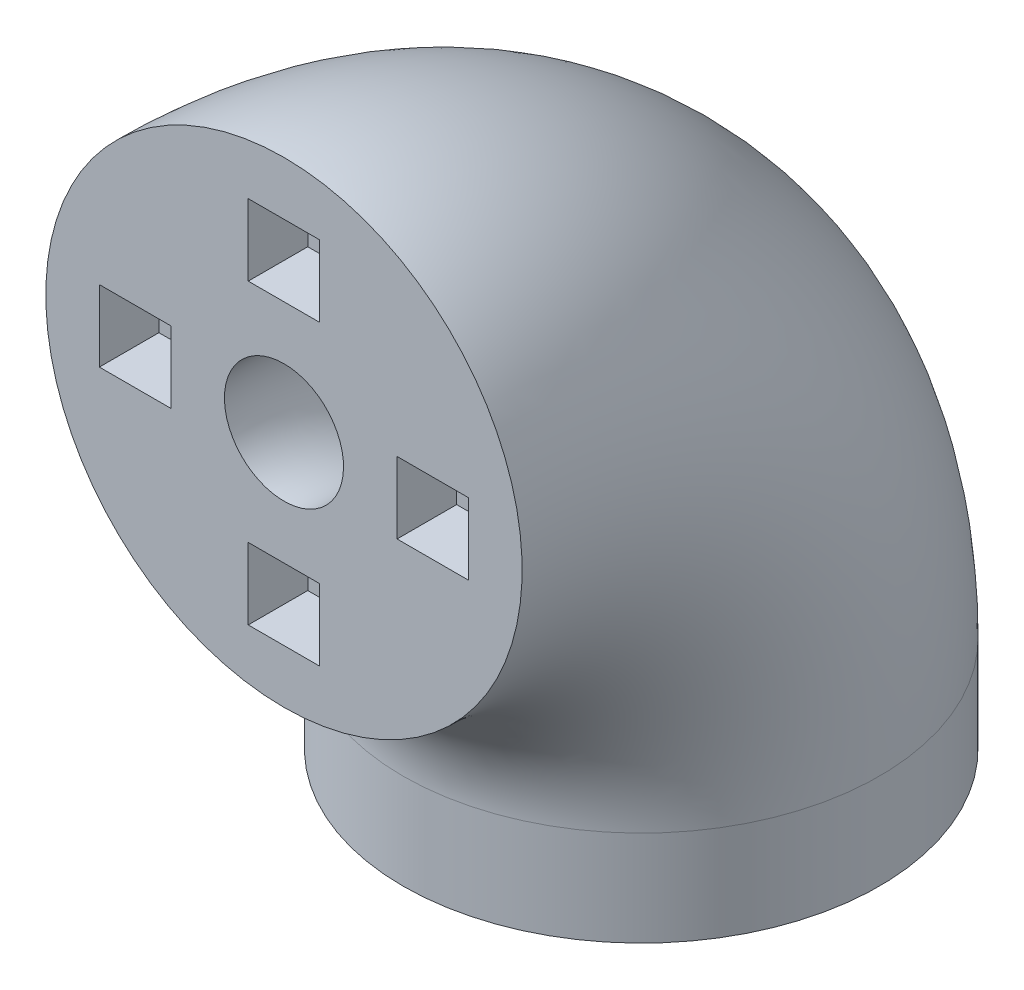
ISO-10303-21;
HEADER;
FILE_DESCRIPTION(('STEP AP214'),'2;1');
FILE_NAME('part.step','',(''),(''),'','','');
FILE_SCHEMA(('AUTOMOTIVE_DESIGN { 1 0 10303 214 1 1 1 1 }'));
ENDSEC;
DATA;
#1=APPLICATION_CONTEXT('core data for automotive mechanical design processes');
#2=APPLICATION_PROTOCOL_DEFINITION('international standard','automotive_design',2000,#1);
#3=PRODUCT_CONTEXT('',#1,'mechanical');
#4=PRODUCT('Part','Part','',(#3));
#5=PRODUCT_RELATED_PRODUCT_CATEGORY('part','',(#4));
#6=PRODUCT_DEFINITION_FORMATION('','',#4);
#7=PRODUCT_DEFINITION_CONTEXT('part definition',#1,'design');
#8=PRODUCT_DEFINITION('design','',#6,#7);
#9=PRODUCT_DEFINITION_SHAPE('','',#8);
#10=(LENGTH_UNIT() NAMED_UNIT(*) SI_UNIT(.MILLI.,.METRE.));
#11=(NAMED_UNIT(*) PLANE_ANGLE_UNIT() SI_UNIT($,.RADIAN.));
#12=(NAMED_UNIT(*) SI_UNIT($,.STERADIAN.) SOLID_ANGLE_UNIT());
#13=UNCERTAINTY_MEASURE_WITH_UNIT(LENGTH_MEASURE(1.E-05),#10,'distance_accuracy_value','');
#14=(GEOMETRIC_REPRESENTATION_CONTEXT(3) GLOBAL_UNCERTAINTY_ASSIGNED_CONTEXT((#13)) GLOBAL_UNIT_ASSIGNED_CONTEXT((#10,
#11,#12)) REPRESENTATION_CONTEXT('',''));
#15=CARTESIAN_POINT('',(0.,0.,0.));
#16=DIRECTION('',(0.,0.,1.));
#17=DIRECTION('',(1.,0.,0.));
#18=AXIS2_PLACEMENT_3D('',#15,#16,#17);
#19=CARTESIAN_POINT('',(0.,0.,0.));
#20=DIRECTION('',(1.,0.,0.));
#21=DIRECTION('',(0.,0.,-1.));
#22=AXIS2_PLACEMENT_3D('',#19,#20,#21);
#23=TOROIDAL_SURFACE('',#22,30.,20.);
#24=CARTESIAN_POINT('',(0.,0.,-30.));
#25=DIRECTION('',(0.,-1.,0.));
#26=DIRECTION('',(0.,0.,-1.));
#27=AXIS2_PLACEMENT_3D('',#24,#25,#26);
#28=CIRCLE('',#27,20.);
#29=CARTESIAN_POINT('',(0.,0.,-50.));
#30=VERTEX_POINT('',#29);
#31=EDGE_CURVE('E337',#30,#30,#28,.T.);
#32=CARTESIAN_POINT('',(0.,30.,0.));
#33=DIRECTION('',(0.,0.,1.));
#34=DIRECTION('',(0.,-1.,0.));
#35=AXIS2_PLACEMENT_3D('',#32,#33,#34);
#36=CIRCLE('',#35,20.);
#37=CARTESIAN_POINT('',(0.,50.,0.));
#38=VERTEX_POINT('',#37);
#39=EDGE_CURVE('E42',#38,#38,#36,.T.);
#40=CARTESIAN_POINT('',(0.,0.,0.));
#41=DIRECTION('',(1.,0.,0.));
#42=DIRECTION('',(0.,0.,-1.));
#43=AXIS2_PLACEMENT_3D('',#40,#41,#42);
#44=CIRCLE('',#43,50.);
#45=EDGE_CURVE('',#30,#38,#44,.T.);
#46=ORIENTED_EDGE('',*,*,#31,.F.);
#47=ORIENTED_EDGE('',*,*,#39,.F.);
#48=ORIENTED_EDGE('',*,*,#45,.T.);
#49=ORIENTED_EDGE('',*,*,#45,.F.);
#50=EDGE_LOOP('',(#46,#48,#47,#49));
#51=FACE_BOUND('',#50,.T.);
#52=ADVANCED_FACE('F39',(#51),#23,.T.);
#53=CARTESIAN_POINT('',(0.,30.,0.));
#54=DIRECTION('',(0.,0.,1.));
#55=DIRECTION('',(0.,-1.,0.));
#56=AXIS2_PLACEMENT_3D('',#53,#54,#55);
#57=PLANE('',#56);
#58=DIRECTION('',(0.,1.,0.));
#59=VECTOR('',#58,1.);
#60=CARTESIAN_POINT('',(-9.50000000000001,33.,0.));
#61=LINE('',#60,#59);
#62=CARTESIAN_POINT('',(-9.50000000000001,27.,0.));
#63=VERTEX_POINT('',#62);
#64=CARTESIAN_POINT('',(-9.50000000000001,33.,0.));
#65=VERTEX_POINT('',#64);
#66=EDGE_CURVE('E54',#63,#65,#61,.T.);
#67=ORIENTED_EDGE('',*,*,#66,.F.);
#68=DIRECTION('',(1.,0.,0.));
#69=VECTOR('',#68,1.);
#70=CARTESIAN_POINT('',(-15.5,27.,0.));
#71=LINE('',#70,#69);
#72=CARTESIAN_POINT('',(-15.5,27.,0.));
#73=VERTEX_POINT('',#72);
#74=EDGE_CURVE('E175',#73,#63,#71,.T.);
#75=ORIENTED_EDGE('',*,*,#74,.F.);
#76=DIRECTION('',(0.,-1.,0.));
#77=VECTOR('',#76,1.);
#78=CARTESIAN_POINT('',(-15.5,33.,0.));
#79=LINE('',#78,#77);
#80=CARTESIAN_POINT('',(-15.5,33.,0.));
#81=VERTEX_POINT('',#80);
#82=EDGE_CURVE('E179',#81,#73,#79,.T.);
#83=ORIENTED_EDGE('',*,*,#82,.F.);
#84=DIRECTION('',(-1.,0.,0.));
#85=VECTOR('',#84,1.);
#86=CARTESIAN_POINT('',(-15.5,33.,0.));
#87=LINE('',#86,#85);
#88=EDGE_CURVE('E188',#65,#81,#87,.T.);
#89=ORIENTED_EDGE('',*,*,#88,.F.);
#90=EDGE_LOOP('',(#67,#75,#83,#89));
#91=FACE_BOUND('',#90,.T.);
#92=DIRECTION('',(0.,-1.,0.));
#93=VECTOR('',#92,1.);
#94=CARTESIAN_POINT('',(-3.00000000000082,45.5000000000016,0.));
#95=LINE('',#94,#93);
#96=CARTESIAN_POINT('',(-3.00000000000082,45.5000000000016,0.));
#97=VERTEX_POINT('',#96);
#98=CARTESIAN_POINT('',(-3.00000000000084,39.5000000000016,0.));
#99=VERTEX_POINT('',#98);
#100=EDGE_CURVE('E62',#97,#99,#95,.T.);
#101=ORIENTED_EDGE('',*,*,#100,.F.);
#102=DIRECTION('',(-1.,0.,0.));
#103=VECTOR('',#102,1.);
#104=CARTESIAN_POINT('',(2.99999999999918,45.5000000000016,0.));
#105=LINE('',#104,#103);
#106=CARTESIAN_POINT('',(2.99999999999918,45.5000000000016,0.));
#107=VERTEX_POINT('',#106);
#108=EDGE_CURVE('E209',#107,#97,#105,.T.);
#109=ORIENTED_EDGE('',*,*,#108,.F.);
#110=DIRECTION('',(0.,1.,0.));
#111=VECTOR('',#110,1.);
#112=CARTESIAN_POINT('',(2.99999999999918,45.5000000000016,0.));
#113=LINE('',#112,#111);
#114=CARTESIAN_POINT('',(2.99999999999916,39.5000000000016,0.));
#115=VERTEX_POINT('',#114);
#116=EDGE_CURVE('E229',#115,#107,#113,.T.);
#117=ORIENTED_EDGE('',*,*,#116,.F.);
#118=DIRECTION('',(1.,0.,0.));
#119=VECTOR('',#118,1.);
#120=CARTESIAN_POINT('',(2.99999999999916,39.5000000000016,0.));
#121=LINE('',#120,#119);
#122=EDGE_CURVE('E224',#99,#115,#121,.T.);
#123=ORIENTED_EDGE('',*,*,#122,.F.);
#124=EDGE_LOOP('',(#101,#109,#117,#123));
#125=FACE_BOUND('',#124,.T.);
#126=DIRECTION('',(-1.,0.,0.));
#127=VECTOR('',#126,1.);
#128=CARTESIAN_POINT('',(15.5000000000007,33.0000000000024,0.));
#129=LINE('',#128,#127);
#130=CARTESIAN_POINT('',(15.5000000000007,33.0000000000024,0.));
#131=VERTEX_POINT('',#130);
#132=CARTESIAN_POINT('',(9.50000000000073,33.0000000000024,0.));
#133=VERTEX_POINT('',#132);
#134=EDGE_CURVE('E264',#131,#133,#129,.T.);
#135=ORIENTED_EDGE('',*,*,#134,.F.);
#136=DIRECTION('',(0.,1.,0.));
#137=VECTOR('',#136,1.);
#138=CARTESIAN_POINT('',(15.5000000000007,27.0000000000024,0.));
#139=LINE('',#138,#137);
#140=CARTESIAN_POINT('',(15.5000000000007,27.0000000000024,0.));
#141=VERTEX_POINT('',#140);
#142=EDGE_CURVE('E251',#141,#131,#139,.T.);
#143=ORIENTED_EDGE('',*,*,#142,.F.);
#144=DIRECTION('',(1.,0.,0.));
#145=VECTOR('',#144,1.);
#146=CARTESIAN_POINT('',(15.5000000000007,27.0000000000024,0.));
#147=LINE('',#146,#145);
#148=CARTESIAN_POINT('',(9.50000000000069,27.0000000000024,0.));
#149=VERTEX_POINT('',#148);
#150=EDGE_CURVE('E272',#149,#141,#147,.T.);
#151=ORIENTED_EDGE('',*,*,#150,.F.);
#152=DIRECTION('',(0.,-1.,0.));
#153=VECTOR('',#152,1.);
#154=CARTESIAN_POINT('',(9.50000000000069,27.0000000000024,0.));
#155=LINE('',#154,#153);
#156=EDGE_CURVE('E267',#133,#149,#155,.T.);
#157=ORIENTED_EDGE('',*,*,#156,.F.);
#158=EDGE_LOOP('',(#135,#143,#151,#157));
#159=FACE_BOUND('',#158,.T.);
#160=DIRECTION('',(0.,1.,0.));
#161=VECTOR('',#160,1.);
#162=CARTESIAN_POINT('',(3.00000000000143,14.5000000000008,0.));
#163=LINE('',#162,#161);
#164=CARTESIAN_POINT('',(3.00000000000143,14.5000000000008,0.));
#165=VERTEX_POINT('',#164);
#166=CARTESIAN_POINT('',(3.00000000000149,20.5000000000008,0.));
#167=VERTEX_POINT('',#166);
#168=EDGE_CURVE('E308',#165,#167,#163,.T.);
#169=ORIENTED_EDGE('',*,*,#168,.F.);
#170=DIRECTION('',(1.,0.,0.));
#171=VECTOR('',#170,1.);
#172=CARTESIAN_POINT('',(-2.99999999999857,14.5000000000009,0.));
#173=LINE('',#172,#171);
#174=CARTESIAN_POINT('',(-2.99999999999857,14.5000000000009,0.));
#175=VERTEX_POINT('',#174);
#176=EDGE_CURVE('E295',#175,#165,#173,.T.);
#177=ORIENTED_EDGE('',*,*,#176,.F.);
#178=DIRECTION('',(0.,-1.,0.));
#179=VECTOR('',#178,1.);
#180=CARTESIAN_POINT('',(-2.99999999999857,14.5000000000009,0.));
#181=LINE('',#180,#179);
#182=CARTESIAN_POINT('',(-2.9999999999985,20.5000000000009,0.));
#183=VERTEX_POINT('',#182);
#184=EDGE_CURVE('E315',#183,#175,#181,.T.);
#185=ORIENTED_EDGE('',*,*,#184,.F.);
#186=DIRECTION('',(-1.,0.,0.));
#187=VECTOR('',#186,1.);
#188=CARTESIAN_POINT('',(-2.9999999999985,20.5000000000009,0.));
#189=LINE('',#188,#187);
#190=EDGE_CURVE('E311',#167,#183,#189,.T.);
#191=ORIENTED_EDGE('',*,*,#190,.F.);
#192=EDGE_LOOP('',(#169,#177,#185,#191));
#193=FACE_BOUND('',#192,.T.);
#194=CARTESIAN_POINT('',(0.,30.,0.));
#195=DIRECTION('',(0.,0.,1.));
#196=DIRECTION('',(0.,-1.,0.));
#197=AXIS2_PLACEMENT_3D('',#194,#195,#196);
#198=CIRCLE('',#197,5.);
#199=CARTESIAN_POINT('',(0.,35.,0.));
#200=VERTEX_POINT('',#199);
#201=EDGE_CURVE('E11',#200,#200,#198,.F.);
#202=ORIENTED_EDGE('',*,*,#201,.T.);
#203=EDGE_LOOP('',(#202));
#204=FACE_BOUND('',#203,.T.);
#205=ORIENTED_EDGE('',*,*,#39,.T.);
#206=EDGE_LOOP('',(#205));
#207=FACE_BOUND('',#206,.T.);
#208=ADVANCED_FACE('F352',(#91,#125,#159,#193,#204,#207),#57,.T.);
#209=CARTESIAN_POINT('',(0.,0.,0.));
#210=DIRECTION('',(1.,0.,0.));
#211=DIRECTION('',(0.,0.,-1.));
#212=AXIS2_PLACEMENT_3D('',#209,#210,#211);
#213=TOROIDAL_SURFACE('',#212,30.,5.);
#214=CARTESIAN_POINT('',(0.,0.,-30.));
#215=DIRECTION('',(0.,-1.,0.));
#216=DIRECTION('',(0.,0.,-1.));
#217=AXIS2_PLACEMENT_3D('',#214,#215,#216);
#218=CIRCLE('',#217,5.);
#219=CARTESIAN_POINT('',(0.,0.,-35.));
#220=VERTEX_POINT('',#219);
#221=EDGE_CURVE('E198',#220,#220,#218,.T.);
#222=CARTESIAN_POINT('',(0.,0.,0.));
#223=DIRECTION('',(1.,0.,0.));
#224=DIRECTION('',(0.,0.,-1.));
#225=AXIS2_PLACEMENT_3D('',#222,#223,#224);
#226=CIRCLE('',#225,35.);
#227=EDGE_CURVE('',#220,#200,#226,.T.);
#228=ORIENTED_EDGE('',*,*,#221,.T.);
#229=ORIENTED_EDGE('',*,*,#201,.F.);
#230=ORIENTED_EDGE('',*,*,#227,.T.);
#231=ORIENTED_EDGE('',*,*,#227,.F.);
#232=EDGE_LOOP('',(#228,#230,#229,#231));
#233=FACE_BOUND('',#232,.T.);
#234=ADVANCED_FACE('F358',(#233),#213,.F.);
#235=CARTESIAN_POINT('',(0.,-8.,-30.));
#236=DIRECTION('',(0.,-1.,0.));
#237=DIRECTION('',(0.,0.,-1.));
#238=AXIS2_PLACEMENT_3D('',#235,#236,#237);
#239=PLANE('',#238);
#240=CARTESIAN_POINT('',(0.,-8.,-30.));
#241=DIRECTION('',(0.,-1.,0.));
#242=DIRECTION('',(0.,0.,-1.));
#243=AXIS2_PLACEMENT_3D('',#240,#241,#242);
#244=CIRCLE('',#243,20.);
#245=CARTESIAN_POINT('',(0.,-8.,-50.));
#246=VERTEX_POINT('',#245);
#247=EDGE_CURVE('E341',#246,#246,#244,.T.);
#248=ORIENTED_EDGE('',*,*,#247,.T.);
#249=EDGE_LOOP('',(#248));
#250=FACE_BOUND('',#249,.T.);
#251=CARTESIAN_POINT('',(0.,-8.,-30.));
#252=DIRECTION('',(0.,-1.,0.));
#253=DIRECTION('',(0.,0.,-1.));
#254=AXIS2_PLACEMENT_3D('',#251,#252,#253);
#255=CIRCLE('',#254,5.);
#256=CARTESIAN_POINT('',(0.,-8.,-35.));
#257=VERTEX_POINT('',#256);
#258=EDGE_CURVE('E333',#257,#257,#255,.T.);
#259=ORIENTED_EDGE('',*,*,#258,.F.);
#260=EDGE_LOOP('',(#259));
#261=FACE_BOUND('',#260,.T.);
#262=ADVANCED_FACE('F354',(#250,#261),#239,.T.);
#263=CARTESIAN_POINT('',(0.,-8.,-30.));
#264=DIRECTION('',(0.,1.,0.));
#265=DIRECTION('',(0.,0.,1.));
#266=AXIS2_PLACEMENT_3D('',#263,#264,#265);
#267=CYLINDRICAL_SURFACE('',#266,20.);
#268=ORIENTED_EDGE('',*,*,#247,.F.);
#269=EDGE_LOOP('',(#268));
#270=FACE_BOUND('',#269,.T.);
#271=ORIENTED_EDGE('',*,*,#31,.T.);
#272=EDGE_LOOP('',(#271));
#273=FACE_BOUND('',#272,.T.);
#274=ADVANCED_FACE('F349',(#270,#273),#267,.T.);
#275=CARTESIAN_POINT('',(0.,-8.,-30.));
#276=DIRECTION('',(0.,1.,0.));
#277=DIRECTION('',(0.,0.,1.));
#278=AXIS2_PLACEMENT_3D('',#275,#276,#277);
#279=CYLINDRICAL_SURFACE('',#278,5.);
#280=ORIENTED_EDGE('',*,*,#258,.T.);
#281=EDGE_LOOP('',(#280));
#282=FACE_BOUND('',#281,.T.);
#283=ORIENTED_EDGE('',*,*,#221,.F.);
#284=EDGE_LOOP('',(#283));
#285=FACE_BOUND('',#284,.T.);
#286=ADVANCED_FACE('F373',(#282,#285),#279,.F.);
#287=CARTESIAN_POINT('',(3.00000000000143,14.5000000000008,-5.));
#288=DIRECTION('',(1.,0.,0.));
#289=DIRECTION('',(0.,1.,0.));
#290=AXIS2_PLACEMENT_3D('',#287,#288,#289);
#291=PLANE('',#290);
#292=ORIENTED_EDGE('',*,*,#168,.T.);
#293=DIRECTION('',(0.,0.,1.));
#294=VECTOR('',#293,1.);
#295=CARTESIAN_POINT('',(3.00000000000149,20.5000000000008,-5.));
#296=LINE('',#295,#294);
#297=CARTESIAN_POINT('',(3.00000000000149,20.5000000000008,-5.));
#298=VERTEX_POINT('',#297);
#299=EDGE_CURVE('E307',#298,#167,#296,.T.);
#300=ORIENTED_EDGE('',*,*,#299,.F.);
#301=DIRECTION('',(0.,1.,0.));
#302=VECTOR('',#301,1.);
#303=CARTESIAN_POINT('',(3.00000000000143,14.5000000000008,-5.));
#304=LINE('',#303,#302);
#305=CARTESIAN_POINT('',(3.00000000000143,14.5000000000008,-5.));
#306=VERTEX_POINT('',#305);
#307=EDGE_CURVE('E290',#306,#298,#304,.T.);
#308=ORIENTED_EDGE('',*,*,#307,.F.);
#309=DIRECTION('',(0.,0.,1.));
#310=VECTOR('',#309,1.);
#311=CARTESIAN_POINT('',(3.00000000000143,14.5000000000008,-5.));
#312=LINE('',#311,#310);
#313=EDGE_CURVE('E268',#306,#165,#312,.T.);
#314=ORIENTED_EDGE('',*,*,#313,.T.);
#315=EDGE_LOOP('',(#292,#300,#308,#314));
#316=FACE_BOUND('',#315,.T.);
#317=ADVANCED_FACE('F378',(#316),#291,.F.);
#318=CARTESIAN_POINT('',(-2.99999999999857,14.5000000000009,-5.));
#319=DIRECTION('',(0.,-1.,0.));
#320=DIRECTION('',(1.,0.,0.));
#321=AXIS2_PLACEMENT_3D('',#318,#319,#320);
#322=PLANE('',#321);
#323=ORIENTED_EDGE('',*,*,#176,.T.);
#324=ORIENTED_EDGE('',*,*,#313,.F.);
#325=DIRECTION('',(1.,0.,0.));
#326=VECTOR('',#325,1.);
#327=CARTESIAN_POINT('',(-2.99999999999857,14.5000000000009,-5.));
#328=LINE('',#327,#326);
#329=CARTESIAN_POINT('',(-2.99999999999857,14.5000000000009,-5.));
#330=VERTEX_POINT('',#329);
#331=EDGE_CURVE('E303',#330,#306,#328,.T.);
#332=ORIENTED_EDGE('',*,*,#331,.F.);
#333=DIRECTION('',(0.,0.,1.));
#334=VECTOR('',#333,1.);
#335=CARTESIAN_POINT('',(-2.99999999999857,14.5000000000009,-5.));
#336=LINE('',#335,#334);
#337=EDGE_CURVE('E324',#330,#175,#336,.T.);
#338=ORIENTED_EDGE('',*,*,#337,.T.);
#339=EDGE_LOOP('',(#323,#324,#332,#338));
#340=FACE_BOUND('',#339,.T.);
#341=ADVANCED_FACE('F382',(#340),#322,.F.);
#342=CARTESIAN_POINT('',(-2.99999999999857,14.5000000000009,-5.));
#343=DIRECTION('',(-1.,0.,0.));
#344=DIRECTION('',(0.,-1.,0.));
#345=AXIS2_PLACEMENT_3D('',#342,#343,#344);
#346=PLANE('',#345);
#347=ORIENTED_EDGE('',*,*,#184,.T.);
#348=ORIENTED_EDGE('',*,*,#337,.F.);
#349=DIRECTION('',(0.,-1.,0.));
#350=VECTOR('',#349,1.);
#351=CARTESIAN_POINT('',(-2.99999999999857,14.5000000000009,-5.));
#352=LINE('',#351,#350);
#353=CARTESIAN_POINT('',(-2.9999999999985,20.5000000000009,-5.));
#354=VERTEX_POINT('',#353);
#355=EDGE_CURVE('E299',#354,#330,#352,.T.);
#356=ORIENTED_EDGE('',*,*,#355,.F.);
#357=DIRECTION('',(0.,0.,1.));
#358=VECTOR('',#357,1.);
#359=CARTESIAN_POINT('',(-2.9999999999985,20.5000000000009,-5.));
#360=LINE('',#359,#358);
#361=EDGE_CURVE('E327',#354,#183,#360,.T.);
#362=ORIENTED_EDGE('',*,*,#361,.T.);
#363=EDGE_LOOP('',(#347,#348,#356,#362));
#364=FACE_BOUND('',#363,.T.);
#365=ADVANCED_FACE('F388',(#364),#346,.F.);
#366=CARTESIAN_POINT('',(-2.9999999999985,20.5000000000009,-5.));
#367=DIRECTION('',(0.,1.,0.));
#368=DIRECTION('',(-1.,0.,0.));
#369=AXIS2_PLACEMENT_3D('',#366,#367,#368);
#370=PLANE('',#369);
#371=ORIENTED_EDGE('',*,*,#190,.T.);
#372=ORIENTED_EDGE('',*,*,#361,.F.);
#373=DIRECTION('',(-1.,0.,0.));
#374=VECTOR('',#373,1.);
#375=CARTESIAN_POINT('',(-2.9999999999985,20.5000000000009,-5.));
#376=LINE('',#375,#374);
#377=EDGE_CURVE('E294',#298,#354,#376,.T.);
#378=ORIENTED_EDGE('',*,*,#377,.F.);
#379=ORIENTED_EDGE('',*,*,#299,.T.);
#380=EDGE_LOOP('',(#371,#372,#378,#379));
#381=FACE_BOUND('',#380,.T.);
#382=ADVANCED_FACE('F384',(#381),#370,.F.);
#383=CARTESIAN_POINT('',(0.,0.,-5.));
#384=DIRECTION('',(0.,0.,-1.));
#385=DIRECTION('',(-1.,0.,0.));
#386=AXIS2_PLACEMENT_3D('',#383,#384,#385);
#387=PLANE('',#386);
#388=ORIENTED_EDGE('',*,*,#307,.T.);
#389=ORIENTED_EDGE('',*,*,#377,.T.);
#390=ORIENTED_EDGE('',*,*,#355,.T.);
#391=ORIENTED_EDGE('',*,*,#331,.T.);
#392=EDGE_LOOP('',(#388,#389,#390,#391));
#393=FACE_BOUND('',#392,.T.);
#394=ADVANCED_FACE('F387',(#393),#387,.F.);
#395=CARTESIAN_POINT('',(15.5000000000007,33.0000000000024,-5.));
#396=DIRECTION('',(0.,1.,0.));
#397=DIRECTION('',(-1.,0.,0.));
#398=AXIS2_PLACEMENT_3D('',#395,#396,#397);
#399=PLANE('',#398);
#400=ORIENTED_EDGE('',*,*,#134,.T.);
#401=DIRECTION('',(0.,0.,1.));
#402=VECTOR('',#401,1.);
#403=CARTESIAN_POINT('',(9.50000000000073,33.0000000000024,-5.));
#404=LINE('',#403,#402);
#405=CARTESIAN_POINT('',(9.50000000000073,33.0000000000024,-5.));
#406=VERTEX_POINT('',#405);
#407=EDGE_CURVE('E263',#406,#133,#404,.T.);
#408=ORIENTED_EDGE('',*,*,#407,.F.);
#409=DIRECTION('',(-1.,0.,0.));
#410=VECTOR('',#409,1.);
#411=CARTESIAN_POINT('',(15.5000000000007,33.0000000000024,-5.));
#412=LINE('',#411,#410);
#413=CARTESIAN_POINT('',(15.5000000000007,33.0000000000024,-5.));
#414=VERTEX_POINT('',#413);
#415=EDGE_CURVE('E246',#414,#406,#412,.T.);
#416=ORIENTED_EDGE('',*,*,#415,.F.);
#417=DIRECTION('',(0.,0.,1.));
#418=VECTOR('',#417,1.);
#419=CARTESIAN_POINT('',(15.5000000000007,33.0000000000024,-5.));
#420=LINE('',#419,#418);
#421=EDGE_CURVE('E225',#414,#131,#420,.T.);
#422=ORIENTED_EDGE('',*,*,#421,.T.);
#423=EDGE_LOOP('',(#400,#408,#416,#422));
#424=FACE_BOUND('',#423,.T.);
#425=ADVANCED_FACE('F398',(#424),#399,.F.);
#426=CARTESIAN_POINT('',(15.5000000000007,27.0000000000024,-5.));
#427=DIRECTION('',(1.,0.,0.));
#428=DIRECTION('',(0.,1.,0.));
#429=AXIS2_PLACEMENT_3D('',#426,#427,#428);
#430=PLANE('',#429);
#431=ORIENTED_EDGE('',*,*,#142,.T.);
#432=ORIENTED_EDGE('',*,*,#421,.F.);
#433=DIRECTION('',(0.,1.,0.));
#434=VECTOR('',#433,1.);
#435=CARTESIAN_POINT('',(15.5000000000007,27.0000000000024,-5.));
#436=LINE('',#435,#434);
#437=CARTESIAN_POINT('',(15.5000000000007,27.0000000000024,-5.));
#438=VERTEX_POINT('',#437);
#439=EDGE_CURVE('E259',#438,#414,#436,.T.);
#440=ORIENTED_EDGE('',*,*,#439,.F.);
#441=DIRECTION('',(0.,0.,1.));
#442=VECTOR('',#441,1.);
#443=CARTESIAN_POINT('',(15.5000000000007,27.0000000000024,-5.));
#444=LINE('',#443,#442);
#445=EDGE_CURVE('E281',#438,#141,#444,.T.);
#446=ORIENTED_EDGE('',*,*,#445,.T.);
#447=EDGE_LOOP('',(#431,#432,#440,#446));
#448=FACE_BOUND('',#447,.T.);
#449=ADVANCED_FACE('F402',(#448),#430,.F.);
#450=CARTESIAN_POINT('',(15.5000000000007,27.0000000000024,-5.));
#451=DIRECTION('',(0.,-1.,0.));
#452=DIRECTION('',(1.,0.,0.));
#453=AXIS2_PLACEMENT_3D('',#450,#451,#452);
#454=PLANE('',#453);
#455=ORIENTED_EDGE('',*,*,#150,.T.);
#456=ORIENTED_EDGE('',*,*,#445,.F.);
#457=DIRECTION('',(1.,0.,0.));
#458=VECTOR('',#457,1.);
#459=CARTESIAN_POINT('',(15.5000000000007,27.0000000000024,-5.));
#460=LINE('',#459,#458);
#461=CARTESIAN_POINT('',(9.50000000000069,27.0000000000024,-5.));
#462=VERTEX_POINT('',#461);
#463=EDGE_CURVE('E255',#462,#438,#460,.T.);
#464=ORIENTED_EDGE('',*,*,#463,.F.);
#465=DIRECTION('',(0.,0.,1.));
#466=VECTOR('',#465,1.);
#467=CARTESIAN_POINT('',(9.50000000000069,27.0000000000024,-5.));
#468=LINE('',#467,#466);
#469=EDGE_CURVE('E284',#462,#149,#468,.T.);
#470=ORIENTED_EDGE('',*,*,#469,.T.);
#471=EDGE_LOOP('',(#455,#456,#464,#470));
#472=FACE_BOUND('',#471,.T.);
#473=ADVANCED_FACE('F408',(#472),#454,.F.);
#474=CARTESIAN_POINT('',(9.50000000000069,27.0000000000024,-5.));
#475=DIRECTION('',(-1.,0.,0.));
#476=DIRECTION('',(0.,-1.,0.));
#477=AXIS2_PLACEMENT_3D('',#474,#475,#476);
#478=PLANE('',#477);
#479=ORIENTED_EDGE('',*,*,#156,.T.);
#480=ORIENTED_EDGE('',*,*,#469,.F.);
#481=DIRECTION('',(0.,-1.,0.));
#482=VECTOR('',#481,1.);
#483=CARTESIAN_POINT('',(9.50000000000069,27.0000000000024,-5.));
#484=LINE('',#483,#482);
#485=EDGE_CURVE('E250',#406,#462,#484,.T.);
#486=ORIENTED_EDGE('',*,*,#485,.F.);
#487=ORIENTED_EDGE('',*,*,#407,.T.);
#488=EDGE_LOOP('',(#479,#480,#486,#487));
#489=FACE_BOUND('',#488,.T.);
#490=ADVANCED_FACE('F404',(#489),#478,.F.);
#491=CARTESIAN_POINT('',(0.,0.,-5.));
#492=DIRECTION('',(0.,0.,-1.));
#493=DIRECTION('',(-1.,0.,0.));
#494=AXIS2_PLACEMENT_3D('',#491,#492,#493);
#495=PLANE('',#494);
#496=ORIENTED_EDGE('',*,*,#415,.T.);
#497=ORIENTED_EDGE('',*,*,#485,.T.);
#498=ORIENTED_EDGE('',*,*,#463,.T.);
#499=ORIENTED_EDGE('',*,*,#439,.T.);
#500=EDGE_LOOP('',(#496,#497,#498,#499));
#501=FACE_BOUND('',#500,.T.);
#502=ADVANCED_FACE('F407',(#501),#495,.F.);
#503=CARTESIAN_POINT('',(-3.00000000000082,45.5000000000016,-5.));
#504=DIRECTION('',(-1.,0.,0.));
#505=DIRECTION('',(0.,-1.,0.));
#506=AXIS2_PLACEMENT_3D('',#503,#504,#505);
#507=PLANE('',#506);
#508=ORIENTED_EDGE('',*,*,#100,.T.);
#509=DIRECTION('',(0.,0.,1.));
#510=VECTOR('',#509,1.);
#511=CARTESIAN_POINT('',(-3.00000000000084,39.5000000000016,-5.));
#512=LINE('',#511,#510);
#513=CARTESIAN_POINT('',(-3.00000000000084,39.5000000000016,-5.));
#514=VERTEX_POINT('',#513);
#515=EDGE_CURVE('E221',#514,#99,#512,.T.);
#516=ORIENTED_EDGE('',*,*,#515,.F.);
#517=DIRECTION('',(0.,-1.,0.));
#518=VECTOR('',#517,1.);
#519=CARTESIAN_POINT('',(-3.00000000000082,45.5000000000016,-5.));
#520=LINE('',#519,#518);
#521=CARTESIAN_POINT('',(-3.00000000000082,45.5000000000016,-5.));
#522=VERTEX_POINT('',#521);
#523=EDGE_CURVE('E204',#522,#514,#520,.T.);
#524=ORIENTED_EDGE('',*,*,#523,.F.);
#525=DIRECTION('',(0.,0.,1.));
#526=VECTOR('',#525,1.);
#527=CARTESIAN_POINT('',(-3.00000000000082,45.5000000000016,-5.));
#528=LINE('',#527,#526);
#529=EDGE_CURVE('E189',#522,#97,#528,.T.);
#530=ORIENTED_EDGE('',*,*,#529,.T.);
#531=EDGE_LOOP('',(#508,#516,#524,#530));
#532=FACE_BOUND('',#531,.T.);
#533=ADVANCED_FACE('F418',(#532),#507,.F.);
#534=CARTESIAN_POINT('',(2.99999999999918,45.5000000000016,-5.));
#535=DIRECTION('',(0.,1.,0.));
#536=DIRECTION('',(-1.,0.,0.));
#537=AXIS2_PLACEMENT_3D('',#534,#535,#536);
#538=PLANE('',#537);
#539=ORIENTED_EDGE('',*,*,#108,.T.);
#540=ORIENTED_EDGE('',*,*,#529,.F.);
#541=DIRECTION('',(-1.,0.,0.));
#542=VECTOR('',#541,1.);
#543=CARTESIAN_POINT('',(2.99999999999918,45.5000000000016,-5.));
#544=LINE('',#543,#542);
#545=CARTESIAN_POINT('',(2.99999999999918,45.5000000000016,-5.));
#546=VERTEX_POINT('',#545);
#547=EDGE_CURVE('E217',#546,#522,#544,.T.);
#548=ORIENTED_EDGE('',*,*,#547,.F.);
#549=DIRECTION('',(0.,0.,1.));
#550=VECTOR('',#549,1.);
#551=CARTESIAN_POINT('',(2.99999999999918,45.5000000000016,-5.));
#552=LINE('',#551,#550);
#553=EDGE_CURVE('E238',#546,#107,#552,.T.);
#554=ORIENTED_EDGE('',*,*,#553,.T.);
#555=EDGE_LOOP('',(#539,#540,#548,#554));
#556=FACE_BOUND('',#555,.T.);
#557=ADVANCED_FACE('F422',(#556),#538,.F.);
#558=CARTESIAN_POINT('',(2.99999999999918,45.5000000000016,-5.));
#559=DIRECTION('',(1.,0.,0.));
#560=DIRECTION('',(0.,1.,0.));
#561=AXIS2_PLACEMENT_3D('',#558,#559,#560);
#562=PLANE('',#561);
#563=ORIENTED_EDGE('',*,*,#116,.T.);
#564=ORIENTED_EDGE('',*,*,#553,.F.);
#565=DIRECTION('',(0.,1.,0.));
#566=VECTOR('',#565,1.);
#567=CARTESIAN_POINT('',(2.99999999999918,45.5000000000016,-5.));
#568=LINE('',#567,#566);
#569=CARTESIAN_POINT('',(2.99999999999916,39.5000000000016,-5.));
#570=VERTEX_POINT('',#569);
#571=EDGE_CURVE('E213',#570,#546,#568,.T.);
#572=ORIENTED_EDGE('',*,*,#571,.F.);
#573=DIRECTION('',(0.,0.,1.));
#574=VECTOR('',#573,1.);
#575=CARTESIAN_POINT('',(2.99999999999916,39.5000000000016,-5.));
#576=LINE('',#575,#574);
#577=EDGE_CURVE('E241',#570,#115,#576,.T.);
#578=ORIENTED_EDGE('',*,*,#577,.T.);
#579=EDGE_LOOP('',(#563,#564,#572,#578));
#580=FACE_BOUND('',#579,.T.);
#581=ADVANCED_FACE('F427',(#580),#562,.F.);
#582=CARTESIAN_POINT('',(2.99999999999916,39.5000000000016,-5.));
#583=DIRECTION('',(0.,-1.,0.));
#584=DIRECTION('',(1.,0.,0.));
#585=AXIS2_PLACEMENT_3D('',#582,#583,#584);
#586=PLANE('',#585);
#587=ORIENTED_EDGE('',*,*,#122,.T.);
#588=ORIENTED_EDGE('',*,*,#577,.F.);
#589=DIRECTION('',(1.,0.,0.));
#590=VECTOR('',#589,1.);
#591=CARTESIAN_POINT('',(2.99999999999916,39.5000000000016,-5.));
#592=LINE('',#591,#590);
#593=EDGE_CURVE('E208',#514,#570,#592,.T.);
#594=ORIENTED_EDGE('',*,*,#593,.F.);
#595=ORIENTED_EDGE('',*,*,#515,.T.);
#596=EDGE_LOOP('',(#587,#588,#594,#595));
#597=FACE_BOUND('',#596,.T.);
#598=ADVANCED_FACE('F423',(#597),#586,.F.);
#599=CARTESIAN_POINT('',(0.,0.,-5.));
#600=DIRECTION('',(0.,0.,-1.));
#601=DIRECTION('',(-1.,0.,0.));
#602=AXIS2_PLACEMENT_3D('',#599,#600,#601);
#603=PLANE('',#602);
#604=ORIENTED_EDGE('',*,*,#523,.T.);
#605=ORIENTED_EDGE('',*,*,#593,.T.);
#606=ORIENTED_EDGE('',*,*,#571,.T.);
#607=ORIENTED_EDGE('',*,*,#547,.T.);
#608=EDGE_LOOP('',(#604,#605,#606,#607));
#609=FACE_BOUND('',#608,.T.);
#610=ADVANCED_FACE('F426',(#609),#603,.F.);
#611=CARTESIAN_POINT('',(-9.50000000000001,33.,-5.));
#612=DIRECTION('',(1.,0.,0.));
#613=DIRECTION('',(0.,0.,-1.));
#614=AXIS2_PLACEMENT_3D('',#611,#612,#613);
#615=PLANE('',#614);
#616=ORIENTED_EDGE('',*,*,#66,.T.);
#617=DIRECTION('',(0.,0.,1.));
#618=VECTOR('',#617,1.);
#619=CARTESIAN_POINT('',(-9.50000000000001,33.,-5.));
#620=LINE('',#619,#618);
#621=CARTESIAN_POINT('',(-9.50000000000001,33.,-5.));
#622=VERTEX_POINT('',#621);
#623=EDGE_CURVE('E150',#622,#65,#620,.T.);
#624=ORIENTED_EDGE('',*,*,#623,.F.);
#625=DIRECTION('',(0.,1.,0.));
#626=VECTOR('',#625,1.);
#627=CARTESIAN_POINT('',(-9.50000000000001,33.,-5.));
#628=LINE('',#627,#626);
#629=CARTESIAN_POINT('',(-9.50000000000001,27.,-5.));
#630=VERTEX_POINT('',#629);
#631=EDGE_CURVE('E154',#630,#622,#628,.T.);
#632=ORIENTED_EDGE('',*,*,#631,.F.);
#633=DIRECTION('',(0.,0.,1.));
#634=VECTOR('',#633,1.);
#635=CARTESIAN_POINT('',(-9.50000000000001,27.,-5.));
#636=LINE('',#635,#634);
#637=EDGE_CURVE('E195',#630,#63,#636,.T.);
#638=ORIENTED_EDGE('',*,*,#637,.T.);
#639=EDGE_LOOP('',(#616,#624,#632,#638));
#640=FACE_BOUND('',#639,.T.);
#641=ADVANCED_FACE('F152',(#640),#615,.F.);
#642=CARTESIAN_POINT('',(-15.5,27.,-5.));
#643=DIRECTION('',(0.,-1.,0.));
#644=DIRECTION('',(0.,0.,-1.));
#645=AXIS2_PLACEMENT_3D('',#642,#643,#644);
#646=PLANE('',#645);
#647=ORIENTED_EDGE('',*,*,#74,.T.);
#648=ORIENTED_EDGE('',*,*,#637,.F.);
#649=DIRECTION('',(1.,0.,0.));
#650=VECTOR('',#649,1.);
#651=CARTESIAN_POINT('',(-15.5,27.,-5.));
#652=LINE('',#651,#650);
#653=CARTESIAN_POINT('',(-15.5,27.,-5.));
#654=VERTEX_POINT('',#653);
#655=EDGE_CURVE('E161',#654,#630,#652,.T.);
#656=ORIENTED_EDGE('',*,*,#655,.F.);
#657=DIRECTION('',(0.,0.,1.));
#658=VECTOR('',#657,1.);
#659=CARTESIAN_POINT('',(-15.5,27.,-5.));
#660=LINE('',#659,#658);
#661=EDGE_CURVE('E199',#654,#73,#660,.T.);
#662=ORIENTED_EDGE('',*,*,#661,.T.);
#663=EDGE_LOOP('',(#647,#648,#656,#662));
#664=FACE_BOUND('',#663,.T.);
#665=ADVANCED_FACE('F440',(#664),#646,.F.);
#666=CARTESIAN_POINT('',(-15.5,33.,-5.));
#667=DIRECTION('',(-1.,0.,0.));
#668=DIRECTION('',(0.,0.,1.));
#669=AXIS2_PLACEMENT_3D('',#666,#667,#668);
#670=PLANE('',#669);
#671=ORIENTED_EDGE('',*,*,#82,.T.);
#672=ORIENTED_EDGE('',*,*,#661,.F.);
#673=DIRECTION('',(0.,-1.,0.));
#674=VECTOR('',#673,1.);
#675=CARTESIAN_POINT('',(-15.5,33.,-5.));
#676=LINE('',#675,#674);
#677=CARTESIAN_POINT('',(-15.5,33.,-5.));
#678=VERTEX_POINT('',#677);
#679=EDGE_CURVE('E170',#678,#654,#676,.T.);
#680=ORIENTED_EDGE('',*,*,#679,.F.);
#681=DIRECTION('',(0.,0.,1.));
#682=VECTOR('',#681,1.);
#683=CARTESIAN_POINT('',(-15.5,33.,-5.));
#684=LINE('',#683,#682);
#685=EDGE_CURVE('E160',#678,#81,#684,.T.);
#686=ORIENTED_EDGE('',*,*,#685,.T.);
#687=EDGE_LOOP('',(#671,#672,#680,#686));
#688=FACE_BOUND('',#687,.T.);
#689=ADVANCED_FACE('F443',(#688),#670,.F.);
#690=CARTESIAN_POINT('',(-15.5,33.,-5.));
#691=DIRECTION('',(0.,1.,0.));
#692=DIRECTION('',(0.,0.,1.));
#693=AXIS2_PLACEMENT_3D('',#690,#691,#692);
#694=PLANE('',#693);
#695=ORIENTED_EDGE('',*,*,#88,.T.);
#696=ORIENTED_EDGE('',*,*,#685,.F.);
#697=DIRECTION('',(-1.,0.,0.));
#698=VECTOR('',#697,1.);
#699=CARTESIAN_POINT('',(-15.5,33.,-5.));
#700=LINE('',#699,#698);
#701=EDGE_CURVE('E164',#622,#678,#700,.T.);
#702=ORIENTED_EDGE('',*,*,#701,.F.);
#703=ORIENTED_EDGE('',*,*,#623,.T.);
#704=EDGE_LOOP('',(#695,#696,#702,#703));
#705=FACE_BOUND('',#704,.T.);
#706=ADVANCED_FACE('F165',(#705),#694,.F.);
#707=CARTESIAN_POINT('',(0.,0.,-5.));
#708=DIRECTION('',(0.,0.,1.));
#709=DIRECTION('',(1.,0.,0.));
#710=AXIS2_PLACEMENT_3D('',#707,#708,#709);
#711=PLANE('',#710);
#712=ORIENTED_EDGE('',*,*,#631,.T.);
#713=ORIENTED_EDGE('',*,*,#701,.T.);
#714=ORIENTED_EDGE('',*,*,#679,.T.);
#715=ORIENTED_EDGE('',*,*,#655,.T.);
#716=EDGE_LOOP('',(#712,#713,#714,#715));
#717=FACE_BOUND('',#716,.T.);
#718=ADVANCED_FACE('F172',(#717),#711,.T.);
#719=CLOSED_SHELL('',(#52,#208,#234,#262,#274,#286,#317,#341,#365,#382,#394,#425,#449,#473,#490,
#502,#533,#557,#581,#598,#610,#641,#665,#689,#706,#718));
#720=MANIFOLD_SOLID_BREP('B2',#719);
#721=ADVANCED_BREP_SHAPE_REPRESENTATION('',(#18,#720),#14);
#722=SHAPE_DEFINITION_REPRESENTATION(#9,#721);
ENDSEC;
END-ISO-10303-21;
